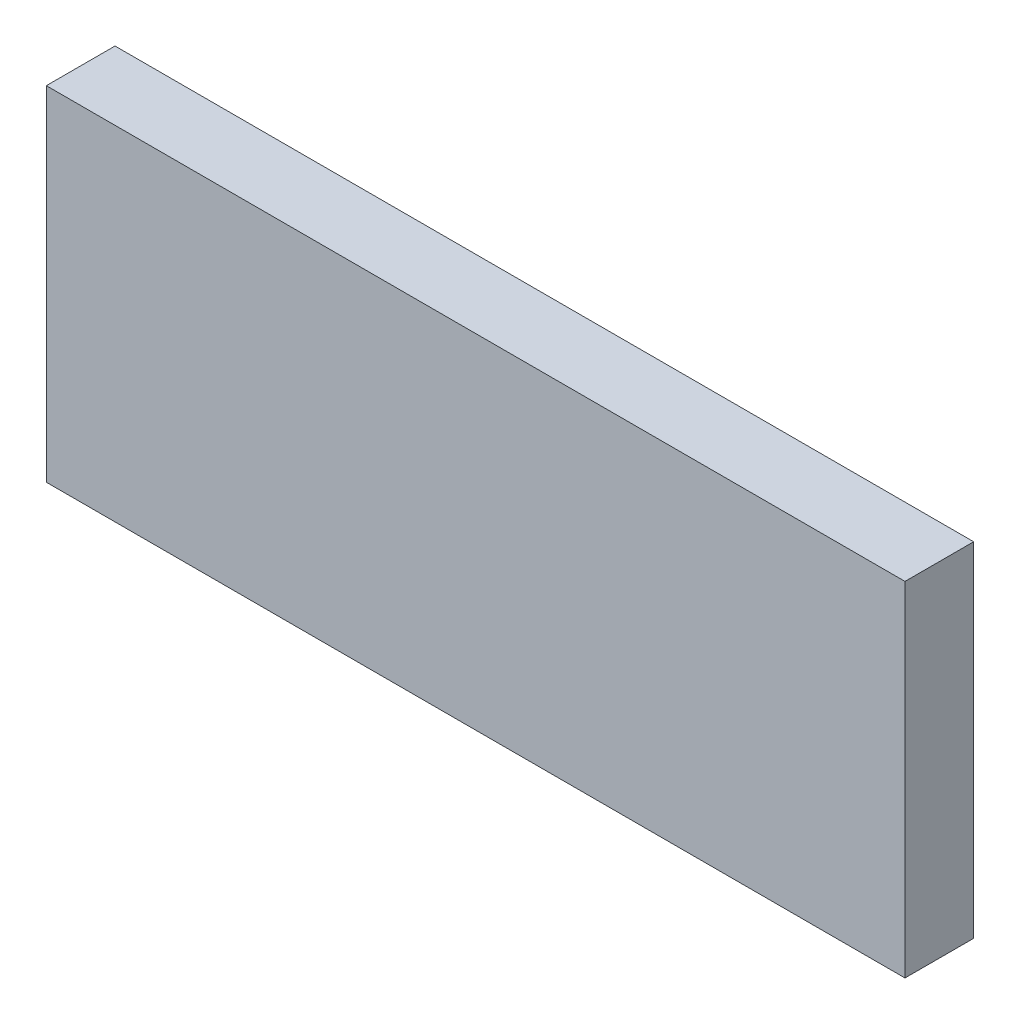
ISO-10303-21;
HEADER;
FILE_DESCRIPTION(('STEP AP214'),'2;1');
FILE_NAME('part.step','',(''),(''),'','','');
FILE_SCHEMA(('AUTOMOTIVE_DESIGN { 1 0 10303 214 1 1 1 1 }'));
ENDSEC;
DATA;
#1=APPLICATION_CONTEXT('core data for automotive mechanical design processes');
#2=APPLICATION_PROTOCOL_DEFINITION('international standard','automotive_design',2000,#1);
#3=PRODUCT_CONTEXT('',#1,'mechanical');
#4=PRODUCT('Part','Part','',(#3));
#5=PRODUCT_RELATED_PRODUCT_CATEGORY('part','',(#4));
#6=PRODUCT_DEFINITION_FORMATION('','',#4);
#7=PRODUCT_DEFINITION_CONTEXT('part definition',#1,'design');
#8=PRODUCT_DEFINITION('design','',#6,#7);
#9=PRODUCT_DEFINITION_SHAPE('','',#8);
#10=(LENGTH_UNIT() NAMED_UNIT(*) SI_UNIT(.MILLI.,.METRE.));
#11=(NAMED_UNIT(*) PLANE_ANGLE_UNIT() SI_UNIT($,.RADIAN.));
#12=(NAMED_UNIT(*) SI_UNIT($,.STERADIAN.) SOLID_ANGLE_UNIT());
#13=UNCERTAINTY_MEASURE_WITH_UNIT(LENGTH_MEASURE(1.E-05),#10,'distance_accuracy_value','');
#14=(GEOMETRIC_REPRESENTATION_CONTEXT(3) GLOBAL_UNCERTAINTY_ASSIGNED_CONTEXT((#13)) GLOBAL_UNIT_ASSIGNED_CONTEXT((#10,
#11,#12)) REPRESENTATION_CONTEXT('',''));
#15=CARTESIAN_POINT('',(0.,0.,0.));
#16=DIRECTION('',(0.,0.,1.));
#17=DIRECTION('',(1.,0.,0.));
#18=AXIS2_PLACEMENT_3D('',#15,#16,#17);
#19=CARTESIAN_POINT('',(0.,0.,50.));
#20=DIRECTION('',(1.,0.,0.));
#21=DIRECTION('',(0.,0.,-1.));
#22=AXIS2_PLACEMENT_3D('',#19,#20,#21);
#23=PLANE('',#22);
#24=DIRECTION('',(0.,-1.,0.));
#25=VECTOR('',#24,1.);
#26=CARTESIAN_POINT('',(0.,0.,0.));
#27=LINE('',#26,#25);
#28=CARTESIAN_POINT('',(0.,250.,0.));
#29=VERTEX_POINT('',#28);
#30=CARTESIAN_POINT('',(0.,0.,0.));
#31=VERTEX_POINT('',#30);
#32=EDGE_CURVE('E99',#29,#31,#27,.T.);
#33=ORIENTED_EDGE('',*,*,#32,.T.);
#34=DIRECTION('',(0.,0.,-1.));
#35=VECTOR('',#34,1.);
#36=CARTESIAN_POINT('',(0.,0.,50.));
#37=LINE('',#36,#35);
#38=CARTESIAN_POINT('',(0.,0.,50.));
#39=VERTEX_POINT('',#38);
#40=EDGE_CURVE('E11',#39,#31,#37,.T.);
#41=ORIENTED_EDGE('',*,*,#40,.F.);
#42=DIRECTION('',(0.,-1.,0.));
#43=VECTOR('',#42,1.);
#44=CARTESIAN_POINT('',(0.,0.,50.));
#45=LINE('',#44,#43);
#46=CARTESIAN_POINT('',(0.,250.,50.));
#47=VERTEX_POINT('',#46);
#48=EDGE_CURVE('E87',#47,#39,#45,.T.);
#49=ORIENTED_EDGE('',*,*,#48,.F.);
#50=DIRECTION('',(0.,0.,-1.));
#51=VECTOR('',#50,1.);
#52=CARTESIAN_POINT('',(0.,250.,50.));
#53=LINE('',#52,#51);
#54=EDGE_CURVE('E95',#47,#29,#53,.T.);
#55=ORIENTED_EDGE('',*,*,#54,.T.);
#56=EDGE_LOOP('',(#33,#41,#49,#55));
#57=FACE_BOUND('',#56,.T.);
#58=ADVANCED_FACE('F36',(#57),#23,.F.);
#59=CARTESIAN_POINT('',(0.,0.,50.));
#60=DIRECTION('',(0.,1.,0.));
#61=DIRECTION('',(0.,0.,1.));
#62=AXIS2_PLACEMENT_3D('',#59,#60,#61);
#63=PLANE('',#62);
#64=DIRECTION('',(1.,0.,0.));
#65=VECTOR('',#64,1.);
#66=CARTESIAN_POINT('',(0.,0.,0.));
#67=LINE('',#66,#65);
#68=CARTESIAN_POINT('',(625.,0.,0.));
#69=VERTEX_POINT('',#68);
#70=EDGE_CURVE('E91',#31,#69,#67,.T.);
#71=ORIENTED_EDGE('',*,*,#70,.T.);
#72=DIRECTION('',(0.,0.,-1.));
#73=VECTOR('',#72,1.);
#74=CARTESIAN_POINT('',(625.,0.,50.));
#75=LINE('',#74,#73);
#76=CARTESIAN_POINT('',(625.,0.,50.));
#77=VERTEX_POINT('',#76);
#78=EDGE_CURVE('E44',#77,#69,#75,.T.);
#79=ORIENTED_EDGE('',*,*,#78,.F.);
#80=DIRECTION('',(1.,0.,0.));
#81=VECTOR('',#80,1.);
#82=CARTESIAN_POINT('',(0.,0.,50.));
#83=LINE('',#82,#81);
#84=EDGE_CURVE('E82',#39,#77,#83,.T.);
#85=ORIENTED_EDGE('',*,*,#84,.F.);
#86=ORIENTED_EDGE('',*,*,#40,.T.);
#87=EDGE_LOOP('',(#71,#79,#85,#86));
#88=FACE_BOUND('',#87,.T.);
#89=ADVANCED_FACE('F90',(#88),#63,.F.);
#90=CARTESIAN_POINT('',(625.,0.,50.));
#91=DIRECTION('',(-1.,0.,0.));
#92=DIRECTION('',(0.,0.,1.));
#93=AXIS2_PLACEMENT_3D('',#90,#91,#92);
#94=PLANE('',#93);
#95=DIRECTION('',(0.,1.,0.));
#96=VECTOR('',#95,1.);
#97=CARTESIAN_POINT('',(625.,0.,0.));
#98=LINE('',#97,#96);
#99=CARTESIAN_POINT('',(625.,250.,0.));
#100=VERTEX_POINT('',#99);
#101=EDGE_CURVE('E69',#69,#100,#98,.T.);
#102=ORIENTED_EDGE('',*,*,#101,.T.);
#103=DIRECTION('',(0.,0.,-1.));
#104=VECTOR('',#103,1.);
#105=CARTESIAN_POINT('',(625.,250.,50.));
#106=LINE('',#105,#104);
#107=CARTESIAN_POINT('',(625.,250.,50.));
#108=VERTEX_POINT('',#107);
#109=EDGE_CURVE('E92',#108,#100,#106,.T.);
#110=ORIENTED_EDGE('',*,*,#109,.F.);
#111=DIRECTION('',(0.,1.,0.));
#112=VECTOR('',#111,1.);
#113=CARTESIAN_POINT('',(625.,0.,50.));
#114=LINE('',#113,#112);
#115=EDGE_CURVE('E85',#77,#108,#114,.T.);
#116=ORIENTED_EDGE('',*,*,#115,.F.);
#117=ORIENTED_EDGE('',*,*,#78,.T.);
#118=EDGE_LOOP('',(#102,#110,#116,#117));
#119=FACE_BOUND('',#118,.T.);
#120=ADVANCED_FACE('F93',(#119),#94,.F.);
#121=CARTESIAN_POINT('',(0.,250.,50.));
#122=DIRECTION('',(0.,-1.,0.));
#123=DIRECTION('',(0.,0.,-1.));
#124=AXIS2_PLACEMENT_3D('',#121,#122,#123);
#125=PLANE('',#124);
#126=DIRECTION('',(-1.,0.,0.));
#127=VECTOR('',#126,1.);
#128=CARTESIAN_POINT('',(0.,250.,0.));
#129=LINE('',#128,#127);
#130=EDGE_CURVE('E75',#100,#29,#129,.T.);
#131=ORIENTED_EDGE('',*,*,#130,.T.);
#132=ORIENTED_EDGE('',*,*,#54,.F.);
#133=DIRECTION('',(-1.,0.,0.));
#134=VECTOR('',#133,1.);
#135=CARTESIAN_POINT('',(0.,250.,50.));
#136=LINE('',#135,#134);
#137=EDGE_CURVE('E52',#108,#47,#136,.T.);
#138=ORIENTED_EDGE('',*,*,#137,.F.);
#139=ORIENTED_EDGE('',*,*,#109,.T.);
#140=EDGE_LOOP('',(#131,#132,#138,#139));
#141=FACE_BOUND('',#140,.T.);
#142=ADVANCED_FACE('F106',(#141),#125,.F.);
#143=CARTESIAN_POINT('',(0.,0.,50.));
#144=DIRECTION('',(0.,0.,-1.));
#145=DIRECTION('',(-1.,0.,0.));
#146=AXIS2_PLACEMENT_3D('',#143,#144,#145);
#147=PLANE('',#146);
#148=ORIENTED_EDGE('',*,*,#48,.T.);
#149=ORIENTED_EDGE('',*,*,#84,.T.);
#150=ORIENTED_EDGE('',*,*,#115,.T.);
#151=ORIENTED_EDGE('',*,*,#137,.T.);
#152=EDGE_LOOP('',(#148,#149,#150,#151));
#153=FACE_BOUND('',#152,.T.);
#154=ADVANCED_FACE('F83',(#153),#147,.F.);
#155=CARTESIAN_POINT('',(0.,0.,0.));
#156=DIRECTION('',(0.,0.,-1.));
#157=DIRECTION('',(-1.,0.,0.));
#158=AXIS2_PLACEMENT_3D('',#155,#156,#157);
#159=PLANE('',#158);
#160=ORIENTED_EDGE('',*,*,#32,.F.);
#161=ORIENTED_EDGE('',*,*,#130,.F.);
#162=ORIENTED_EDGE('',*,*,#101,.F.);
#163=ORIENTED_EDGE('',*,*,#70,.F.);
#164=EDGE_LOOP('',(#160,#161,#162,#163));
#165=FACE_BOUND('',#164,.T.);
#166=ADVANCED_FACE('F109',(#165),#159,.T.);
#167=CLOSED_SHELL('',(#58,#89,#120,#142,#154,#166));
#168=MANIFOLD_SOLID_BREP('B2',#167);
#169=ADVANCED_BREP_SHAPE_REPRESENTATION('',(#18,#168),#14);
#170=SHAPE_DEFINITION_REPRESENTATION(#9,#169);
ENDSEC;
END-ISO-10303-21;
